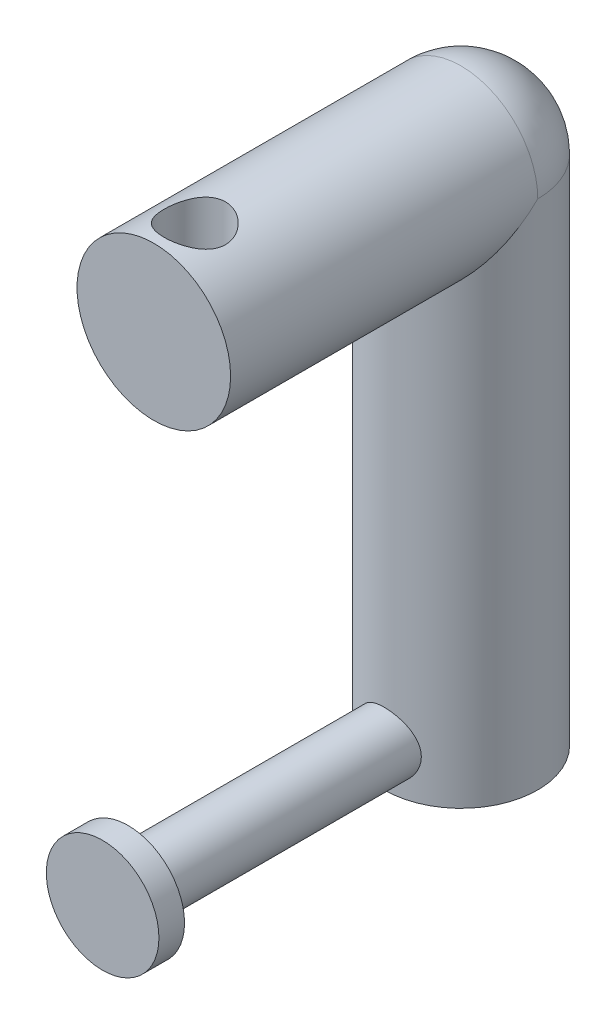
ISO-10303-21;
HEADER;
FILE_DESCRIPTION(('STEP AP214'),'2;1');
FILE_NAME('part.step','',(''),(''),'','','');
FILE_SCHEMA(('AUTOMOTIVE_DESIGN { 1 0 10303 214 1 1 1 1 }'));
ENDSEC;
DATA;
#1=APPLICATION_CONTEXT('core data for automotive mechanical design processes');
#2=APPLICATION_PROTOCOL_DEFINITION('international standard','automotive_design',2000,#1);
#3=PRODUCT_CONTEXT('',#1,'mechanical');
#4=PRODUCT('Part','Part','',(#3));
#5=PRODUCT_RELATED_PRODUCT_CATEGORY('part','',(#4));
#6=PRODUCT_DEFINITION_FORMATION('','',#4);
#7=PRODUCT_DEFINITION_CONTEXT('part definition',#1,'design');
#8=PRODUCT_DEFINITION('design','',#6,#7);
#9=PRODUCT_DEFINITION_SHAPE('','',#8);
#10=(LENGTH_UNIT() NAMED_UNIT(*) SI_UNIT(.MILLI.,.METRE.));
#11=(NAMED_UNIT(*) PLANE_ANGLE_UNIT() SI_UNIT($,.RADIAN.));
#12=(NAMED_UNIT(*) SI_UNIT($,.STERADIAN.) SOLID_ANGLE_UNIT());
#13=UNCERTAINTY_MEASURE_WITH_UNIT(LENGTH_MEASURE(1.E-05),#10,'distance_accuracy_value','');
#14=(GEOMETRIC_REPRESENTATION_CONTEXT(3) GLOBAL_UNCERTAINTY_ASSIGNED_CONTEXT((#13)) GLOBAL_UNIT_ASSIGNED_CONTEXT((#10,
#11,#12)) REPRESENTATION_CONTEXT('',''));
#15=CARTESIAN_POINT('',(0.,0.,0.));
#16=DIRECTION('',(0.,0.,1.));
#17=DIRECTION('',(1.,0.,0.));
#18=AXIS2_PLACEMENT_3D('',#15,#16,#17);
#19=CARTESIAN_POINT('',(0.,8.,65.));
#20=DIRECTION('',(0.,0.,-1.));
#21=DIRECTION('',(-1.,0.,0.));
#22=AXIS2_PLACEMENT_3D('',#19,#20,#21);
#23=CYLINDRICAL_SURFACE('',#22,6.);
#24=CARTESIAN_POINT('',(0.,8.,65.));
#25=DIRECTION('',(0.,0.,1.));
#26=DIRECTION('',(1.,0.,0.));
#27=AXIS2_PLACEMENT_3D('',#24,#25,#26);
#28=CIRCLE('',#27,6.);
#29=CARTESIAN_POINT('',(6.,8.,65.));
#30=VERTEX_POINT('',#29);
#31=EDGE_CURVE('E11',#30,#30,#28,.T.);
#32=ORIENTED_EDGE('',*,*,#31,.F.);
#33=EDGE_LOOP('',(#32));
#34=FACE_BOUND('',#33,.T.);
#35=CARTESIAN_POINT('',(6.,8.,13.7477270848675));
#36=CARTESIAN_POINT('',(5.99999875640954,8.16076598482738,13.7477283260629));
#37=CARTESIAN_POINT('',(5.99352975206176,8.32158110601548,13.7505565594333));
#38=CARTESIAN_POINT('',(5.96771672897827,8.64204882535129,13.7617785399654));
#39=CARTESIAN_POINT('',(5.94836482999676,8.80170065146873,13.7701756935283));
#40=CARTESIAN_POINT('',(5.89694174030869,9.11890142617686,13.7922754357519));
#41=CARTESIAN_POINT('',(5.86484520413903,9.27644553381237,13.8059885951419));
#42=CARTESIAN_POINT('',(5.78825391878448,9.58804060527395,13.8382744776157));
#43=CARTESIAN_POINT('',(5.74375401859824,9.74209008901072,13.8568492194736));
#44=CARTESIAN_POINT('',(5.64299599700453,10.0449832651282,13.8981849934125));
#45=CARTESIAN_POINT('',(5.58678827846126,10.1938461795796,13.9209280318917));
#46=CARTESIAN_POINT('',(5.46298123967255,10.4861745059142,13.969977180975));
#47=CARTESIAN_POINT('',(5.39537758446074,10.6296378383192,13.9962846467221));
#48=CARTESIAN_POINT('',(5.17633416323045,11.0504811630918,14.0794173286744));
#49=CARTESIAN_POINT('',(5.00853494267613,11.3186931077142,14.1405074748907));
#50=CARTESIAN_POINT('',(4.62391158998239,11.8378592545825,14.2710405221571));
#51=CARTESIAN_POINT('',(4.40499626343136,12.0871970513873,14.340752300891));
#52=CARTESIAN_POINT('',(4.0481020989243,12.4317390645763,14.4439708651047));
#53=CARTESIAN_POINT('',(3.9242905158216,12.5417399755175,14.4781748598032));
#54=CARTESIAN_POINT('',(3.66779743847793,12.7512789373329,14.5452673983772));
#55=CARTESIAN_POINT('',(3.53511902618019,12.850820593021,14.5781563930343));
#56=CARTESIAN_POINT('',(3.25615691069843,13.042541605752,14.6430448615306));
#57=CARTESIAN_POINT('',(3.10954147620186,13.1342681993675,14.6749563607157));
#58=CARTESIAN_POINT('',(2.80847871906791,13.3049385222444,14.7355355933009));
#59=CARTESIAN_POINT('',(2.65403441109174,13.3838871235516,14.7642045617649));
#60=CARTESIAN_POINT('',(2.33831705380736,13.5283274480482,14.8174861755334));
#61=CARTESIAN_POINT('',(2.1770447537532,13.5938206431435,14.8420992644581));
#62=CARTESIAN_POINT('',(1.8488303602226,13.710706307039,14.8865456688032));
#63=CARTESIAN_POINT('',(1.68188862975968,13.762099676745,14.9063792895972));
#64=CARTESIAN_POINT('',(1.35182764993867,13.8480957076311,14.9398371015626));
#65=CARTESIAN_POINT('',(1.18891435676812,13.8833905448022,14.9537153305611));
#66=CARTESIAN_POINT('',(0.860364736698413,13.940333707631,14.9762104160573));
#67=CARTESIAN_POINT('',(0.694728571347245,13.9619828399113,14.9848275835451));
#68=CARTESIAN_POINT('',(0.362083680846929,13.9913910715253,14.9965524359366));
#69=CARTESIAN_POINT('',(0.195075387211748,13.9991543815219,14.9996617909972));
#70=CARTESIAN_POINT('',(-0.139014166426377,14.0007146652515,15.0002858279534));
#71=CARTESIAN_POINT('',(-0.30609542365763,13.9945121299872,14.9978007065363));
#72=CARTESIAN_POINT('',(-0.629581360842823,13.9689571486784,14.9876056811723));
#73=CARTESIAN_POINT('',(-0.786056489987584,13.950366478925,14.9801985155737));
#74=CARTESIAN_POINT('',(-1.09682374164985,13.9009947102182,14.9606558816458));
#75=CARTESIAN_POINT('',(-1.25111513504043,13.8702096346988,14.9485188709466));
#76=CARTESIAN_POINT('',(-1.55636446880933,13.7967547638698,14.9198265516691));
#77=CARTESIAN_POINT('',(-1.70732347781249,13.7540888400518,14.9032726824411));
#78=CARTESIAN_POINT('',(-2.00504692560526,13.6572347463826,14.8661462906548));
#79=CARTESIAN_POINT('',(-2.15180974700395,13.6030421998243,14.8455722418593));
#80=CARTESIAN_POINT('',(-2.44232275401438,13.4827122452092,14.8005733913406));
#81=CARTESIAN_POINT('',(-2.58599723661979,13.4164113777625,14.7760965609745));
#82=CARTESIAN_POINT('',(-2.86725918170996,13.2729288476492,14.7241067343258));
#83=CARTESIAN_POINT('',(-3.00484439132129,13.1957432013856,14.696592627269));
#84=CARTESIAN_POINT('',(-3.40726603321778,12.948688374456,14.6104618941818));
#85=CARTESIAN_POINT('',(-3.66195901653258,12.7632418772394,14.5482260457696));
#86=CARTESIAN_POINT('',(-4.15437949370372,12.3419915764659,14.4156330049764));
#87=CARTESIAN_POINT('',(-4.38989525780835,12.1036809528053,14.3450108782861));
#88=CARTESIAN_POINT('',(-4.71121812404964,11.7191971043517,14.2413889925105));
#89=CARTESIAN_POINT('',(-4.81305918105095,11.5864329939912,14.2072110490304));
#90=CARTESIAN_POINT('',(-5.0054684951315,11.3125897118592,14.1405668936191));
#91=CARTESIAN_POINT('',(-5.09604089492643,11.171513624108,14.1081000551767));
#92=CARTESIAN_POINT('',(-5.2677144885335,10.8776679791937,14.0449207716186));
#93=CARTESIAN_POINT('',(-5.34846830074845,10.7246787891823,14.0142856556237));
#94=CARTESIAN_POINT('',(-5.49666677344656,10.4117640686962,13.9568252487564));
#95=CARTESIAN_POINT('',(-5.56411683616808,10.2518413860096,13.9299984127055));
#96=CARTESIAN_POINT('',(-5.68507549818268,9.92615715736025,13.8810726170423));
#97=CARTESIAN_POINT('',(-5.73858849912392,9.76039747367877,13.8589721651234));
#98=CARTESIAN_POINT('',(-5.83111405710325,9.42425050711976,13.8202977451039));
#99=CARTESIAN_POINT('',(-5.87012778144672,9.2538635979558,13.803723332125));
#100=CARTESIAN_POINT('',(-5.93126188446898,8.92037550293277,13.7775602957139));
#101=CARTESIAN_POINT('',(-5.95426866502425,8.75746509869363,13.7676067715781));
#102=CARTESIAN_POINT('',(-5.98682783069773,8.4300594191083,13.7534799529363));
#103=CARTESIAN_POINT('',(-5.99638101339171,8.26556423829532,13.7493063157788));
#104=CARTESIAN_POINT('',(-6.00192022727181,7.93634499724553,13.7468891908443));
#105=CARTESIAN_POINT('',(-5.99790972463034,7.77162100623468,13.7486441880165));
#106=CARTESIAN_POINT('',(-5.97637695694085,7.44323030234847,13.7580178863429));
#107=CARTESIAN_POINT('',(-5.95885503253298,7.27956356292335,13.7656364396694));
#108=CARTESIAN_POINT('',(-5.91189113707813,6.96388493285905,13.7858678469555));
#109=CARTESIAN_POINT('',(-5.88318889041452,6.81174216524755,13.7981698606254));
#110=CARTESIAN_POINT('',(-5.81422990546568,6.51049878730527,13.8273689308218));
#111=CARTESIAN_POINT('',(-5.77396942701893,6.36139917847391,13.8442674746596));
#112=CARTESIAN_POINT('',(-5.68227161206331,6.0672507608385,13.8821556875076));
#113=CARTESIAN_POINT('',(-5.63083646021821,5.92220116649752,13.9031445567712));
#114=CARTESIAN_POINT('',(-5.51718647350251,5.63689974950036,13.9486342853423));
#115=CARTESIAN_POINT('',(-5.45496750289055,5.49664979237216,13.9731364914375));
#116=CARTESIAN_POINT('',(-5.31751145640008,5.21622103433919,14.0260368054118));
#117=CARTESIAN_POINT('',(-5.24185178482307,5.07627148339986,14.054551887834));
#118=CARTESIAN_POINT('',(-5.07988717682862,4.80313174732677,14.1139004091642));
#119=CARTESIAN_POINT('',(-4.99357859530799,4.66994389885387,14.144734640495));
#120=CARTESIAN_POINT('',(-4.81086355761932,4.41103058661941,14.2079180408565));
#121=CARTESIAN_POINT('',(-4.71445526541627,4.28530648622995,14.2402674847459));
#122=CARTESIAN_POINT('',(-4.51210358125893,4.04197483985672,14.3056711379351));
#123=CARTESIAN_POINT('',(-4.40615981558121,3.92436761231666,14.338725374819));
#124=CARTESIAN_POINT('',(-4.17710486838273,3.68947089789745,14.4071898083664));
#125=CARTESIAN_POINT('',(-4.05330323673504,3.57285146369598,14.442592979753));
#126=CARTESIAN_POINT('',(-3.79611595891185,3.35044107746035,14.5123136561683));
#127=CARTESIAN_POINT('',(-3.66273336488668,3.24464670276108,14.5466315019691));
#128=CARTESIAN_POINT('',(-3.38706145939603,3.04451435610423,14.6132792135403));
#129=CARTESIAN_POINT('',(-3.24476806677012,2.95018169264924,14.6456081547515));
#130=CARTESIAN_POINT('',(-2.95225256674959,2.77378136334621,14.7073633349577));
#131=CARTESIAN_POINT('',(-2.80203390506011,2.69170842578634,14.7367908197248));
#132=CARTESIAN_POINT('',(-2.49453307495679,2.54045157600446,14.7919473555791));
#133=CARTESIAN_POINT('',(-2.3372490996887,2.47127098437562,14.8176754534518));
#134=CARTESIAN_POINT('',(-2.01680521759424,2.34650155372973,14.8646797598965));
#135=CARTESIAN_POINT('',(-1.85364780662784,2.29090701787589,14.8859578338886));
#136=CARTESIAN_POINT('',(-1.52264805192433,2.19385845199868,14.9234471639802));
#137=CARTESIAN_POINT('',(-1.35480680859647,2.15240113036746,14.9396595994531));
#138=CARTESIAN_POINT('',(-1.01574606559106,2.08407562736268,14.9665350610502));
#139=CARTESIAN_POINT('',(-0.844526795116487,2.05720645967028,14.9771984623478));
#140=CARTESIAN_POINT('',(-0.511396994408887,2.01963967541453,14.9921458117432));
#141=CARTESIAN_POINT('',(-0.349608608417646,2.00800071584866,14.9968008342727));
#142=CARTESIAN_POINT('',(-0.0255568035504901,1.99786526314398,15.0008532559057));
#143=CARTESIAN_POINT('',(0.13670659774313,1.99936828956347,15.0002508472092));
#144=CARTESIAN_POINT('',(0.460449157871509,2.01549904517884,14.9938053140504));
#145=CARTESIAN_POINT('',(0.621928426150297,2.03012488656084,14.9879629433954));
#146=CARTESIAN_POINT('',(0.942913616351041,2.07234304237388,14.9711970812456));
#147=CARTESIAN_POINT('',(1.10241954563224,2.09993530843377,14.9602736087057));
#148=CARTESIAN_POINT('',(1.41340092731344,2.16675006249559,14.9340514560138));
#149=CARTESIAN_POINT('',(1.56497209153591,2.20558587323356,14.9188987624389));
#150=CARTESIAN_POINT('',(1.86423948532529,2.29482683138478,14.8844652752771));
#151=CARTESIAN_POINT('',(2.01193442094207,2.34523578871987,14.8651831223981));
#152=CARTESIAN_POINT('',(2.302462712288,2.45717619515102,14.8229622791787));
#153=CARTESIAN_POINT('',(2.44529715629449,2.51870513472082,14.8000244139869));
#154=CARTESIAN_POINT('',(2.72537941223682,2.65243971671062,14.7510179336099));
#155=CARTESIAN_POINT('',(2.86262507421093,2.72464941936831,14.7249481285447));
#156=CARTESIAN_POINT('',(3.13662388518831,2.88260994638361,14.6690826919464));
#157=CARTESIAN_POINT('',(3.27309180108705,2.96881555131694,14.6391738407242));
#158=CARTESIAN_POINT('',(3.53838180351729,3.15171951689201,14.5773253906917));
#159=CARTESIAN_POINT('',(3.66720122604104,3.24842150069047,14.5453850922484));
#160=CARTESIAN_POINT('',(3.91649343612947,3.4517088619109,14.480251425724));
#161=CARTESIAN_POINT('',(4.03696455988819,3.55829619963079,14.447057809883));
#162=CARTESIAN_POINT('',(4.26890539529756,3.78072670262355,14.3802300314779));
#163=CARTESIAN_POINT('',(4.38037483126384,3.89657015115672,14.3465958554578));
#164=CARTESIAN_POINT('',(4.6003520349242,4.14436931770692,14.2776350231095));
#165=CARTESIAN_POINT('',(4.70824454883581,4.27687901691599,14.2423331872708));
#166=CARTESIAN_POINT('',(4.91246454048886,4.55081614977952,14.1731899755842));
#167=CARTESIAN_POINT('',(5.0087959135827,4.69224055512317,14.1393481102969));
#168=CARTESIAN_POINT('',(5.18930521843518,4.98330426589871,14.0741014017048));
#169=CARTESIAN_POINT('',(5.27347593316246,5.13294837739946,14.0426980106418));
#170=CARTESIAN_POINT('',(5.42888140715686,5.43938662075409,13.9833532160291));
#171=CARTESIAN_POINT('',(5.50012246229139,5.59617722596415,13.9554101296628));
#172=CARTESIAN_POINT('',(5.62329338728312,5.90161698772481,13.9062060888812));
#173=CARTESIAN_POINT('',(5.67638059374281,6.0497399517391,13.8845710059473));
#174=CARTESIAN_POINT('',(5.77085722264898,6.3501563851321,13.8455704717994));
#175=CARTESIAN_POINT('',(5.81225194839873,6.5024479292954,13.8282030853728));
#176=CARTESIAN_POINT('',(5.88290316620707,6.80992357107783,13.7982941020336));
#177=CARTESIAN_POINT('',(5.91218652902551,6.9651004584769,13.7857418266595));
#178=CARTESIAN_POINT('',(5.95843701087142,7.27754448449443,13.7658152395796));
#179=CARTESIAN_POINT('',(5.97541127868373,7.43481035575322,13.7584379224814));
#180=CARTESIAN_POINT('',(5.99076318011059,7.66032523302881,13.751755327731));
#181=CARTESIAN_POINT('',(5.99422579943118,7.72819955445766,13.7502459479373));
#182=CARTESIAN_POINT('',(5.99884455686221,7.86404631736154,13.7482315272618));
#183=CARTESIAN_POINT('',(6.00000052586257,7.9320187656651,13.7477265600177));
#184=CARTESIAN_POINT('',(6.,8.,13.7477270848675));
#185=B_SPLINE_CURVE_WITH_KNOTS('',3,(#35,#36,#37,#38,#39,#40,#41,#42,#43,#44,#45,#46,#47,#48,
#49,#50,#51,#52,#53,#54,#55,#56,#57,#58,#59,#60,#61,#62,#63,#64,#65,#66,#67,#68,#69,#70,#71,#72,
#73,#74,#75,#76,#77,#78,#79,#80,#81,#82,#83,#84,#85,#86,#87,#88,#89,#90,#91,#92,#93,#94,#95,#96,
#97,#98,#99,#100,#101,#102,#103,#104,#105,#106,#107,#108,#109,#110,#111,#112,#113,#114,#115,
#116,#117,#118,#119,#120,#121,#122,#123,#124,#125,#126,#127,#128,#129,#130,#131,#132,#133,#134,
#135,#136,#137,#138,#139,#140,#141,#142,#143,#144,#145,#146,#147,#148,#149,#150,#151,#152,#153,
#154,#155,#156,#157,#158,#159,#160,#161,#162,#163,#164,#165,#166,#167,#168,#169,#170,#171,#172,
#173,#174,#175,#176,#177,#178,#179,#180,#181,#182,#183,#184),.UNSPECIFIED.,.T.,.F.,(4,2,2,2,2,2,
2,2,2,2,2,2,2,2,2,2,2,2,2,2,2,2,2,2,2,2,2,2,2,2,2,2,2,2,2,2,2,2,2,2,2,2,2,2,2,2,2,2,2,2,2,2,2,2,
2,2,2,2,2,2,2,2,2,2,2,2,2,2,2,2,2,2,2,2,4),(0.,0.482229125007606,0.964753492666786,
1.44824230932755,1.93193221431692,2.41358131868909,2.89541405552194,3.85788445035762,
4.87027013417452,5.37714851669966,5.88385162504574,6.41078994114098,6.93752686828076,
7.4642061442031,7.99085176020979,8.4920122856123,8.99314318371741,9.49412209577398,
9.99508339499091,10.4677763229104,10.9406235219094,11.4133168189293,11.8861899210207,
12.3659950936627,12.8459763227003,13.8053197638543,14.827648638094,15.3395121452938,
15.8511869156833,16.3775800271824,16.9037589447638,17.429771480738,17.9557416594036,
18.4495809207953,18.9433909044569,19.4370747055101,19.9307460605728,20.3961592499499,
20.8617232138062,21.3271962410503,21.7928481801528,22.2772086524077,22.7617353827804,
23.2463503490362,23.7309843170643,24.2515501140932,24.7719508068031,25.2925916122044,
25.8130078923152,26.3335580277819,26.8538895128004,27.3740997647064,27.8942748403263,
28.3804860466243,28.8666794781986,29.3528029784681,29.8389246652723,30.309990273523,
30.7812111812125,31.2523258775871,31.7236201282936,32.2155707501999,32.7076917276986,
33.1999105039097,33.6921443490278,34.2149887213889,34.7376564316676,35.2606330684224,
35.7833543637692,36.2593204433439,36.7350702933027,37.2097588887462,37.684171576794,
37.8880712265046,38.0919858243933),.UNSPECIFIED.);
#186=CARTESIAN_POINT('',(6.,8.,13.7477270848675));
#187=VERTEX_POINT('',#186);
#188=EDGE_CURVE('E53',#187,#187,#185,.T.);
#189=ORIENTED_EDGE('',*,*,#188,.T.);
#190=EDGE_LOOP('',(#189));
#191=FACE_BOUND('',#190,.T.);
#192=ADVANCED_FACE('F47',(#34,#191),#23,.T.);
#193=CARTESIAN_POINT('',(0.,100.,0.));
#194=DIRECTION('',(0.,-1.,0.));
#195=DIRECTION('',(0.,0.,-1.));
#196=AXIS2_PLACEMENT_3D('',#193,#194,#195);
#197=CYLINDRICAL_SURFACE('',#196,15.);
#198=ORIENTED_EDGE('',*,*,#188,.F.);
#199=EDGE_LOOP('',(#198));
#200=FACE_BOUND('',#199,.T.);
#201=ADVANCED_FACE('F69',(#200),#197,.F.);
#202=CARTESIAN_POINT('',(0.,8.,70.));
#203=DIRECTION('',(0.,0.,-1.));
#204=DIRECTION('',(-1.,0.,0.));
#205=AXIS2_PLACEMENT_3D('',#202,#203,#204);
#206=CYLINDRICAL_SURFACE('',#205,11.);
#207=CARTESIAN_POINT('',(0.,8.,70.));
#208=DIRECTION('',(0.,0.,1.));
#209=DIRECTION('',(1.,0.,0.));
#210=AXIS2_PLACEMENT_3D('',#207,#208,#209);
#211=CIRCLE('',#210,11.);
#212=CARTESIAN_POINT('',(11.,8.,70.));
#213=VERTEX_POINT('',#212);
#214=EDGE_CURVE('E57',#213,#213,#211,.T.);
#215=ORIENTED_EDGE('',*,*,#214,.F.);
#216=EDGE_LOOP('',(#215));
#217=FACE_BOUND('',#216,.T.);
#218=CARTESIAN_POINT('',(0.,8.,65.));
#219=DIRECTION('',(0.,0.,1.));
#220=DIRECTION('',(1.,0.,0.));
#221=AXIS2_PLACEMENT_3D('',#218,#219,#220);
#222=CIRCLE('',#221,11.);
#223=CARTESIAN_POINT('',(11.,8.,65.));
#224=VERTEX_POINT('',#223);
#225=EDGE_CURVE('E61',#224,#224,#222,.T.);
#226=ORIENTED_EDGE('',*,*,#225,.T.);
#227=EDGE_LOOP('',(#226));
#228=FACE_BOUND('',#227,.T.);
#229=ADVANCED_FACE('F73',(#217,#228),#206,.T.);
#230=CARTESIAN_POINT('',(0.,8.,70.));
#231=DIRECTION('',(0.,0.,1.));
#232=DIRECTION('',(1.,0.,0.));
#233=AXIS2_PLACEMENT_3D('',#230,#231,#232);
#234=PLANE('',#233);
#235=ORIENTED_EDGE('',*,*,#214,.T.);
#236=EDGE_LOOP('',(#235));
#237=FACE_BOUND('',#236,.T.);
#238=ADVANCED_FACE('F77',(#237),#234,.T.);
#239=CARTESIAN_POINT('',(0.,8.,65.));
#240=DIRECTION('',(0.,0.,1.));
#241=DIRECTION('',(1.,0.,0.));
#242=AXIS2_PLACEMENT_3D('',#239,#240,#241);
#243=PLANE('',#242);
#244=ORIENTED_EDGE('',*,*,#31,.T.);
#245=EDGE_LOOP('',(#244));
#246=FACE_BOUND('',#245,.T.);
#247=ORIENTED_EDGE('',*,*,#225,.F.);
#248=EDGE_LOOP('',(#247));
#249=FACE_BOUND('',#248,.T.);
#250=ADVANCED_FACE('F79',(#246,#249),#243,.F.);
#251=CLOSED_SHELL('',(#192,#201,#229,#238,#250));
#252=MANIFOLD_SOLID_BREP('B2',#251);
#253=CARTESIAN_POINT('',(0.,100.,0.));
#254=DIRECTION('',(0.,-1.,0.));
#255=DIRECTION('',(0.,0.,-1.));
#256=AXIS2_PLACEMENT_3D('',#253,#254,#255);
#257=CYLINDRICAL_SURFACE('',#256,15.);
#258=CARTESIAN_POINT('',(0.,0.,0.));
#259=DIRECTION('',(0.,1.,0.));
#260=DIRECTION('',(0.,0.,1.));
#261=AXIS2_PLACEMENT_3D('',#258,#259,#260);
#262=CIRCLE('',#261,15.);
#263=CARTESIAN_POINT('',(0.,0.,15.));
#264=VERTEX_POINT('',#263);
#265=EDGE_CURVE('E130',#264,#264,#262,.T.);
#266=ORIENTED_EDGE('',*,*,#265,.T.);
#267=EDGE_LOOP('',(#266));
#268=FACE_BOUND('',#267,.T.);
#269=CARTESIAN_POINT('',(0.,100.,0.));
#270=DIRECTION('',(0.,-0.707106781186547,-0.707106781186547));
#271=DIRECTION('',(0.,-0.707106781186547,0.707106781186547));
#272=AXIS2_PLACEMENT_3D('',#269,#270,#271);
#273=ELLIPSE('',#272,21.2132034355964,15.);
#274=CARTESIAN_POINT('',(-15.,100.,0.));
#275=VERTEX_POINT('',#274);
#276=CARTESIAN_POINT('',(15.,100.,1.04744440165294E-13));
#277=VERTEX_POINT('',#276);
#278=EDGE_CURVE('E141',#275,#277,#273,.F.);
#279=ORIENTED_EDGE('',*,*,#278,.F.);
#280=CARTESIAN_POINT('',(0.,100.,0.));
#281=DIRECTION('',(0.,1.,0.));
#282=DIRECTION('',(0.,0.,1.));
#283=AXIS2_PLACEMENT_3D('',#280,#281,#282);
#284=CIRCLE('',#283,15.);
#285=EDGE_CURVE('E45',#277,#275,#284,.T.);
#286=ORIENTED_EDGE('',*,*,#285,.F.);
#287=EDGE_LOOP('',(#279,#286));
#288=FACE_BOUND('',#287,.T.);
#289=ADVANCED_FACE('F127',(#268,#288),#257,.T.);
#290=CARTESIAN_POINT('',(0.,0.,0.));
#291=DIRECTION('',(0.,1.,0.));
#292=DIRECTION('',(0.,0.,1.));
#293=AXIS2_PLACEMENT_3D('',#290,#291,#292);
#294=PLANE('',#293);
#295=ORIENTED_EDGE('',*,*,#265,.F.);
#296=EDGE_LOOP('',(#295));
#297=FACE_BOUND('',#296,.T.);
#298=ADVANCED_FACE('F155',(#297),#294,.F.);
#299=CARTESIAN_POINT('',(0.,100.,0.));
#300=DIRECTION('',(0.,1.,0.));
#301=DIRECTION('',(-1.,0.,0.));
#302=AXIS2_PLACEMENT_3D('',#299,#300,#301);
#303=SPHERICAL_SURFACE('',#302,15.);
#304=CARTESIAN_POINT('',(0.,100.,0.));
#305=DIRECTION('',(0.,0.,-1.));
#306=DIRECTION('',(-1.,0.,0.));
#307=AXIS2_PLACEMENT_3D('',#304,#305,#306);
#308=CIRCLE('',#307,15.);
#309=EDGE_CURVE('E143',#275,#277,#308,.T.);
#310=ORIENTED_EDGE('',*,*,#309,.T.);
#311=ORIENTED_EDGE('',*,*,#285,.T.);
#312=EDGE_LOOP('',(#310,#311));
#313=FACE_BOUND('',#312,.T.);
#314=ADVANCED_FACE('F153',(#313),#303,.T.);
#315=CARTESIAN_POINT('',(0.,100.,60.));
#316=DIRECTION('',(0.,0.,-1.));
#317=DIRECTION('',(-1.,0.,0.));
#318=AXIS2_PLACEMENT_3D('',#315,#316,#317);
#319=CYLINDRICAL_SURFACE('',#318,15.);
#320=CARTESIAN_POINT('',(0.,85.,58.));
#321=CARTESIAN_POINT('',(-0.161313644504796,85.0000007200578,57.999999076337));
#322=CARTESIAN_POINT('',(-0.322689516963509,85.0026094557128,57.9934855013958));
#323=CARTESIAN_POINT('',(-0.644299623195493,85.0129790603837,57.9674898782125));
#324=CARTESIAN_POINT('',(-0.804533022188132,85.0207433704531,57.9479991684452));
#325=CARTESIAN_POINT('',(-1.12295032515216,85.0412405280905,57.8961896196803));
#326=CARTESIAN_POINT('',(-1.28112908028619,85.0539840252668,57.863843282184));
#327=CARTESIAN_POINT('',(-1.5940111010847,85.0841076474644,57.7866317701457));
#328=CARTESIAN_POINT('',(-1.74871291854088,85.1014896670848,57.741761479865));
#329=CARTESIAN_POINT('',(-2.05297112205075,85.14036525012,57.6401188046392));
#330=CARTESIAN_POINT('',(-2.20254446893524,85.1618433198106,57.5833911959363));
#331=CARTESIAN_POINT('',(-2.49626491179011,85.2084217773626,57.4584017024408));
#332=CARTESIAN_POINT('',(-2.64040995626987,85.2335235177162,57.3901355093753));
#333=CARTESIAN_POINT('',(-2.92227692731373,85.2867119875235,57.2426681971428));
#334=CARTESIAN_POINT('',(-3.06000372368525,85.3147963990348,57.1634755552049));
#335=CARTESIAN_POINT('',(-3.32842124549353,85.3732943072994,56.9946751836688));
#336=CARTESIAN_POINT('',(-3.45910939916273,85.4037086456565,56.9050636845176));
#337=CARTESIAN_POINT('',(-3.8503463050522,85.5000421160479,56.6134009680257));
#338=CARTESIAN_POINT('',(-4.09812078052022,85.5687144016327,56.3947515037883));
#339=CARTESIAN_POINT('',(-4.55459108369287,85.7061993914462,55.9197284822013));
#340=CARTESIAN_POINT('',(-4.76326779263536,85.7750121478253,55.6633365776994));
#341=CARTESIAN_POINT('',(-5.04723766459798,85.8742762880717,55.2488756985875));
#342=CARTESIAN_POINT('',(-5.13866506559553,85.9073651161098,55.1022648970436));
#343=CARTESIAN_POINT('',(-5.30875946518037,85.9705560012794,54.8012358186711));
#344=CARTESIAN_POINT('',(-5.38743171147838,86.0006592847307,54.6468207871239));
#345=CARTESIAN_POINT('',(-5.53135072514938,86.0568964740729,54.3311496933484));
#346=CARTESIAN_POINT('',(-5.59659658448498,86.0830301114623,54.1698931693136));
#347=CARTESIAN_POINT('',(-5.71298893930062,86.1304034348634,53.8417492993048));
#348=CARTESIAN_POINT('',(-5.76414249748569,86.1516455714923,53.6748648211636));
#349=CARTESIAN_POINT('',(-5.84985002952935,86.187638928039,53.3442805788518));
#350=CARTESIAN_POINT('',(-5.88504634552834,86.2026388218328,53.1807744062204));
#351=CARTESIAN_POINT('',(-5.94169028877152,86.2269367964116,52.8510475821048));
#352=CARTESIAN_POINT('',(-5.96314412514811,86.236237452146,52.6848281913697));
#353=CARTESIAN_POINT('',(-5.99206783200916,86.2488046692949,52.3509840794924));
#354=CARTESIAN_POINT('',(-5.99954065663821,86.2520725054236,52.1833596627484));
#355=CARTESIAN_POINT('',(-6.00041818162586,86.2524553603,51.8480709001244));
#356=CARTESIAN_POINT('',(-5.99382353813072,86.2495706660189,51.6804065564715));
#357=CARTESIAN_POINT('',(-5.96760177471961,86.2381719442467,51.3581150722591));
#358=CARTESIAN_POINT('',(-5.94891756277296,86.2300653791778,51.2033956295018));
#359=CARTESIAN_POINT('',(-5.8996396544996,86.2088807245164,50.896159193445));
#360=CARTESIAN_POINT('',(-5.86904203850858,86.1958009987228,50.7436429421696));
#361=CARTESIAN_POINT('',(-5.79624600676145,86.1650771841395,50.4419202009817));
#362=CARTESIAN_POINT('',(-5.75405038400524,86.1474341943228,50.2927129235482));
#363=CARTESIAN_POINT('',(-5.65841794933909,86.1080966894326,49.9984373160379));
#364=CARTESIAN_POINT('',(-5.60497681726873,86.0864006176568,49.8533706010244));
#365=CARTESIAN_POINT('',(-5.48612076549079,86.0391028682875,49.5654107880334));
#366=CARTESIAN_POINT('',(-5.42048769239742,86.0134317403028,49.4226192329473));
#367=CARTESIAN_POINT('',(-5.27846344073438,85.9592165358569,49.1430045696326));
#368=CARTESIAN_POINT('',(-5.20206861926844,85.9306714874992,49.0061835030654));
#369=CARTESIAN_POINT('',(-5.03904071569064,85.8714619338073,48.7392438024992));
#370=CARTESIAN_POINT('',(-4.95240626250741,85.8407971448716,48.6091260694235));
#371=CARTESIAN_POINT('',(-4.7694272064266,85.7781184148979,48.3562485672333));
#372=CARTESIAN_POINT('',(-4.67308210238212,85.7461044042789,48.2334891783898));
#373=CARTESIAN_POINT('',(-4.46337699329054,85.678990833822,47.9867125608195));
#374=CARTESIAN_POINT('',(-4.34927691149484,85.6438445137024,47.8633359835572));
#375=CARTESIAN_POINT('',(-4.11112913327325,85.5738426959587,47.6265800239504));
#376=CARTESIAN_POINT('',(-3.98708438059708,85.53898711562,47.51319770389));
#377=CARTESIAN_POINT('',(-3.72964838124062,85.4704620878226,47.2970234364176));
#378=CARTESIAN_POINT('',(-3.59625179230497,85.436793335118,47.1942376264797));
#379=CARTESIAN_POINT('',(-3.32099627612082,85.3715695205646,47.0000661124244));
#380=CARTESIAN_POINT('',(-3.17914076240929,85.3400136168589,46.9086758551241));
#381=CARTESIAN_POINT('',(-2.88480363244261,85.2792343974222,46.7362002936664));
#382=CARTESIAN_POINT('',(-2.73216491576377,85.2500713242046,46.6553614031936));
#383=CARTESIAN_POINT('',(-2.41997061448609,85.1956481146639,46.5069497525717));
#384=CARTESIAN_POINT('',(-2.26041784404166,85.1703864091648,46.4393716558007));
#385=CARTESIAN_POINT('',(-1.93550182558386,85.124491840955,46.318108247081));
#386=CARTESIAN_POINT('',(-1.77013973685016,85.1038580607185,46.2644201809906));
#387=CARTESIAN_POINT('',(-1.43484781894989,85.0678323195841,46.1714951268274));
#388=CARTESIAN_POINT('',(-1.26491830691482,85.0524399957635,46.1322571382043));
#389=CARTESIAN_POINT('',(-0.932043665210944,85.0281104597,46.0705625046863));
#390=CARTESIAN_POINT('',(-0.769280790194169,85.0188449830014,46.0472497453174));
#391=CARTESIAN_POINT('',(-0.442179347982649,85.0056255915782,46.0140583525531));
#392=CARTESIAN_POINT('',(-0.277840858808296,85.0016714152056,46.0041790573915));
#393=CARTESIAN_POINT('',(0.0510959013325354,84.999185484946,45.9979633536429));
#394=CARTESIAN_POINT('',(0.215694106984595,85.0006525349162,46.0016239576039));
#395=CARTESIAN_POINT('',(0.543895620115944,85.0089652826815,46.0224408619377));
#396=CARTESIAN_POINT('',(0.707498946609738,85.0158108773522,46.0395969035585));
#397=CARTESIAN_POINT('',(1.02510006060182,85.0342616757631,46.0861386822579));
#398=CARTESIAN_POINT('',(1.17919782151467,85.0456378124758,46.1149367227416));
#399=CARTESIAN_POINT('',(1.48434586639605,85.0728372092811,46.1843994061311));
#400=CARTESIAN_POINT('',(1.63539513588515,85.0886619244493,46.2250679318946));
#401=CARTESIAN_POINT('',(1.93337901855314,85.1243635557249,46.3178883378395));
#402=CARTESIAN_POINT('',(2.08031476115195,85.1442393468992,46.3700370304434));
#403=CARTESIAN_POINT('',(2.36928412673675,85.1875778684626,46.4854096029213));
#404=CARTESIAN_POINT('',(2.51131586022716,85.211041962917,46.5486376958812));
#405=CARTESIAN_POINT('',(2.79382655828657,85.261759013214,46.6877436802185));
#406=CARTESIAN_POINT('',(2.93412902369549,85.2891050081393,46.7639459872758));
#407=CARTESIAN_POINT('',(3.20788342050322,85.346363952855,46.9270442086834));
#408=CARTESIAN_POINT('',(3.34133298209498,85.3762777812021,47.0139437874406));
#409=CARTESIAN_POINT('',(3.60064969677007,85.4379572555599,47.1978553315034));
#410=CARTESIAN_POINT('',(3.72651556540459,85.4697232134826,47.2948690022766));
#411=CARTESIAN_POINT('',(3.97000140926484,85.5343524787856,47.4984146200534));
#412=CARTESIAN_POINT('',(4.08762102489383,85.5672158339283,47.6049469816811));
#413=CARTESIAN_POINT('',(4.32151965753385,85.6354507123008,47.8343017011696));
#414=CARTESIAN_POINT('',(4.43719333742261,85.6708441315125,47.9577357303629));
#415=CARTESIAN_POINT('',(4.65775251008148,85.7410121716529,48.2139847630681));
#416=CARTESIAN_POINT('',(4.76264135223886,85.7757869819081,48.346796832349));
#417=CARTESIAN_POINT('',(4.9610580489563,85.8437678138675,48.6211572374989));
#418=CARTESIAN_POINT('',(5.05457937701835,85.8769729277304,48.7627105223442));
#419=CARTESIAN_POINT('',(5.22948651451797,85.9407988293012,49.0536021679197));
#420=CARTESIAN_POINT('',(5.31087742412304,85.9714207007556,49.2029372210024));
#421=CARTESIAN_POINT('',(5.46168285847214,86.0294374243861,49.5101026008407));
#422=CARTESIAN_POINT('',(5.53096653567014,86.0567961127809,49.6680041306304));
#423=CARTESIAN_POINT('',(5.65585321672464,86.1069853252467,49.9897540710099));
#424=CARTESIAN_POINT('',(5.71146207536686,86.1298177863783,50.1535999019847));
#425=CARTESIAN_POINT('',(5.80843082990244,86.1701448950943,50.486032936934));
#426=CARTESIAN_POINT('',(5.84979637281906,86.1876416577986,50.65461823312));
#427=CARTESIAN_POINT('',(5.91782050130812,86.2166486555749,50.9952343023737));
#428=CARTESIAN_POINT('',(5.94448031809037,86.2281593918113,51.1672647857494));
#429=CARTESIAN_POINT('',(5.98138158194365,86.244148716196,51.5008289388823));
#430=CARTESIAN_POINT('',(5.99266704417584,86.2490739888075,51.6622264630661));
#431=CARTESIAN_POINT('',(6.00216046200423,86.2532149589185,51.9854766489458));
#432=CARTESIAN_POINT('',(6.00036897454033,86.2524308995753,52.1473292909651));
#433=CARTESIAN_POINT('',(5.98373064604635,86.2451809080467,52.4702112209036));
#434=CARTESIAN_POINT('',(5.96888538854158,86.2387156650339,52.6312406063074));
#435=CARTESIAN_POINT('',(5.9263097432402,86.2203269663375,52.9512677749796));
#436=CARTESIAN_POINT('',(5.89857941471414,86.2084035357612,53.1102655675898));
#437=CARTESIAN_POINT('',(5.83188915830646,86.1800751428363,53.4187951135104));
#438=CARTESIAN_POINT('',(5.79342041323657,86.1638675614921,53.5684516805446));
#439=CARTESIAN_POINT('',(5.70522097391949,86.127266596468,53.863930328238));
#440=CARTESIAN_POINT('',(5.6554866099175,86.1068718490296,54.0097511420933));
#441=CARTESIAN_POINT('',(5.54517998972386,86.0624783606027,54.296647321415));
#442=CARTESIAN_POINT('',(5.4846091686947,86.0384800969256,54.4377233123424));
#443=CARTESIAN_POINT('',(5.35307990924357,85.9875231301795,54.7144117275927));
#444=CARTESIAN_POINT('',(5.28211769758923,85.9605633526433,54.8500221443966));
#445=CARTESIAN_POINT('',(5.04570156991896,85.8730685439742,55.2626644137898));
#446=CARTESIAN_POINT('',(4.86295379872225,85.8085485390652,55.5291851425362));
#447=CARTESIAN_POINT('',(4.4576185471272,85.6760708558405,56.0290508408562));
#448=CARTESIAN_POINT('',(4.2350190587282,85.6081121458242,56.2623857728528));
#449=CARTESIAN_POINT('',(3.86726006921135,85.5064855119623,56.5906111142667));
#450=CARTESIAN_POINT('',(3.73448315683694,85.4716249640093,56.6992669907362));
#451=CARTESIAN_POINT('',(3.45982226643504,85.403781141815,56.9050013050422));
#452=CARTESIAN_POINT('',(3.31794165644068,85.3707971817292,57.0020839869774));
#453=CARTESIAN_POINT('',(3.02578567613311,85.307587521917,57.1840400830178));
#454=CARTESIAN_POINT('',(2.87550254240776,85.2773644433031,57.2689019381306));
#455=CARTESIAN_POINT('',(2.56769193761231,85.2205740377765,57.4255655037111));
#456=CARTESIAN_POINT('',(2.41016781863784,85.1940050415595,57.4973731826112));
#457=CARTESIAN_POINT('',(2.09182205260197,85.1457168766986,57.6261198404165));
#458=CARTESIAN_POINT('',(1.93111197302126,85.1239185114088,57.6833047935241));
#459=CARTESIAN_POINT('',(1.60493222642554,85.0852038339497,57.7838828055145));
#460=CARTESIAN_POINT('',(1.43946483501728,85.0682852289621,57.8272823426273));
#461=CARTESIAN_POINT('',(1.10541479414028,85.0398498586039,57.8997628026109));
#462=CARTESIAN_POINT('',(0.936841087451797,85.0283195321336,57.9288796810461));
#463=CARTESIAN_POINT('',(0.59761820577061,85.0109489226024,57.9726090796245));
#464=CARTESIAN_POINT('',(0.426970701489365,85.0051043315317,57.9872325813745));
#465=CARTESIAN_POINT('',(0.213390422685862,85.0014570552551,57.9963563929729));
#466=CARTESIAN_POINT('',(0.170726823310688,85.0009108974964,57.99772244129));
#467=CARTESIAN_POINT('',(0.0853769353554073,85.0001822746741,57.9995443668125));
#468=CARTESIAN_POINT('',(0.0426906467858722,84.9999998094412,58.0000002444416));
#469=CARTESIAN_POINT('',(0.,85.,58.));
#470=B_SPLINE_CURVE_WITH_KNOTS('',3,(#320,#321,#322,#323,#324,#325,#326,#327,#328,#329,#330,
#331,#332,#333,#334,#335,#336,#337,#338,#339,#340,#341,#342,#343,#344,#345,#346,#347,#348,#349,
#350,#351,#352,#353,#354,#355,#356,#357,#358,#359,#360,#361,#362,#363,#364,#365,#366,#367,#368,
#369,#370,#371,#372,#373,#374,#375,#376,#377,#378,#379,#380,#381,#382,#383,#384,#385,#386,#387,
#388,#389,#390,#391,#392,#393,#394,#395,#396,#397,#398,#399,#400,#401,#402,#403,#404,#405,#406,
#407,#408,#409,#410,#411,#412,#413,#414,#415,#416,#417,#418,#419,#420,#421,#422,#423,#424,#425,
#426,#427,#428,#429,#430,#431,#432,#433,#434,#435,#436,#437,#438,#439,#440,#441,#442,#443,#444,
#445,#446,#447,#448,#449,#450,#451,#452,#453,#454,#455,#456,#457,#458,#459,#460,#461,#462,#463,
#464,#465,#466,#467,#468,#469),.UNSPECIFIED.,.T.,.F.,(4,2,2,2,2,2,2,2,2,2,2,2,2,2,2,2,2,2,2,2,2,
2,2,2,2,2,2,2,2,2,2,2,2,2,2,2,2,2,2,2,2,2,2,2,2,2,2,2,2,2,2,2,2,2,2,2,2,2,2,2,2,2,2,2,2,2,2,2,2,
2,2,2,2,2,4),(0.,0.48389705415282,0.968117407228015,1.45337914245595,1.93883938645661,
2.42249849868244,2.90633859994029,3.38980540538342,3.87344767714067,4.88128652111307,
5.8896169181335,6.41682474002604,6.94381510524777,7.47084109954819,7.99760247923351,
8.50070582790118,9.00358170358742,9.50635131114939,10.0090974686366,10.4767118882454,
10.9444802892416,11.4121361420904,11.8799719822379,12.357167111748,12.8345241636783,
13.3119452055687,13.7893908988145,14.3038604025315,14.8181781750485,15.3327921850973,
15.8471999136586,16.3720340444751,16.8966565279702,17.4211749084574,17.945656963481,
18.4390821626358,18.9324830535441,19.4257750866616,19.9190576619765,20.3900487373938,
20.8611940478454,21.3322087049456,21.8034028617177,22.2888301938794,22.7744242768985,
23.2601003750447,23.7457976390534,24.2636804561109,24.7814019482706,25.299419292813,
25.8172182216539,26.3403070717152,26.8631715731925,27.3858285361306,27.9084417339339,
28.3934227501986,28.8783831115163,29.3632846514299,29.8481839608478,30.3137727734817,
30.7795134694854,31.2451925291595,31.7110411034411,32.695156070987,33.6795680697381,
34.2042554172968,34.7287497567621,35.2537369726936,35.7784835549451,36.2937161550921,
36.8087062706882,37.3223931958723,37.8356906031082,37.9637509906823,38.0918113186414),.UNSPECIFIED.);
#471=CARTESIAN_POINT('',(0.,85.,58.));
#472=VERTEX_POINT('',#471);
#473=EDGE_CURVE('E175',#472,#472,#470,.T.);
#474=ORIENTED_EDGE('',*,*,#473,.F.);
#475=EDGE_LOOP('',(#474));
#476=FACE_BOUND('',#475,.T.);
#477=CARTESIAN_POINT('',(0.,115.,58.));
#478=CARTESIAN_POINT('',(0.161313644504796,114.999999279942,57.999999076337));
#479=CARTESIAN_POINT('',(0.322689516963509,114.997390544287,57.9934855013958));
#480=CARTESIAN_POINT('',(0.644299623195493,114.987020939616,57.9674898782125));
#481=CARTESIAN_POINT('',(0.804533022188132,114.979256629547,57.9479991684452));
#482=CARTESIAN_POINT('',(1.12295032515216,114.958759471909,57.8961896196803));
#483=CARTESIAN_POINT('',(1.28112908028619,114.946015974733,57.863843282184));
#484=CARTESIAN_POINT('',(1.5940111010847,114.915892352536,57.7866317701457));
#485=CARTESIAN_POINT('',(1.74871291854088,114.898510332915,57.741761479865));
#486=CARTESIAN_POINT('',(2.05297112205075,114.85963474988,57.6401188046392));
#487=CARTESIAN_POINT('',(2.20254446893524,114.838156680189,57.5833911959363));
#488=CARTESIAN_POINT('',(2.49626491179011,114.791578222637,57.4584017024408));
#489=CARTESIAN_POINT('',(2.64040995626987,114.766476482284,57.3901355093753));
#490=CARTESIAN_POINT('',(2.92227692731373,114.713288012477,57.2426681971428));
#491=CARTESIAN_POINT('',(3.06000372368525,114.685203600965,57.1634755552049));
#492=CARTESIAN_POINT('',(3.32842124549353,114.626705692701,56.9946751836688));
#493=CARTESIAN_POINT('',(3.45910939916273,114.596291354344,56.9050636845176));
#494=CARTESIAN_POINT('',(3.8503463050522,114.499957883952,56.6134009680257));
#495=CARTESIAN_POINT('',(4.09812078052022,114.431285598367,56.3947515037883));
#496=CARTESIAN_POINT('',(4.55459108369287,114.293800608554,55.9197284822013));
#497=CARTESIAN_POINT('',(4.76326779263536,114.224987852175,55.6633365776994));
#498=CARTESIAN_POINT('',(5.04723766459798,114.125723711928,55.2488756985875));
#499=CARTESIAN_POINT('',(5.13866506559553,114.09263488389,55.1022648970436));
#500=CARTESIAN_POINT('',(5.30875946518037,114.029443998721,54.8012358186711));
#501=CARTESIAN_POINT('',(5.38743171147838,113.999340715269,54.6468207871239));
#502=CARTESIAN_POINT('',(5.53135072514938,113.943103525927,54.3311496933484));
#503=CARTESIAN_POINT('',(5.59659658448498,113.916969888538,54.1698931693136));
#504=CARTESIAN_POINT('',(5.71298893930062,113.869596565137,53.8417492993048));
#505=CARTESIAN_POINT('',(5.76414249748569,113.848354428508,53.6748648211636));
#506=CARTESIAN_POINT('',(5.84985002952935,113.812361071961,53.3442805788518));
#507=CARTESIAN_POINT('',(5.88504634552834,113.797361178167,53.1807744062204));
#508=CARTESIAN_POINT('',(5.94169028877152,113.773063203588,52.8510475821048));
#509=CARTESIAN_POINT('',(5.96314412514811,113.763762547854,52.6848281913697));
#510=CARTESIAN_POINT('',(5.99206783200916,113.751195330705,52.3509840794924));
#511=CARTESIAN_POINT('',(5.99954065663821,113.747927494576,52.1833596627484));
#512=CARTESIAN_POINT('',(6.00041818162586,113.7475446397,51.8480709001244));
#513=CARTESIAN_POINT('',(5.99382353813072,113.750429333981,51.6804065564715));
#514=CARTESIAN_POINT('',(5.96760177471961,113.761828055753,51.3581150722591));
#515=CARTESIAN_POINT('',(5.94891756277296,113.769934620822,51.2033956295018));
#516=CARTESIAN_POINT('',(5.8996396544996,113.791119275484,50.896159193445));
#517=CARTESIAN_POINT('',(5.86904203850858,113.804199001277,50.7436429421696));
#518=CARTESIAN_POINT('',(5.79624600676145,113.83492281586,50.4419202009817));
#519=CARTESIAN_POINT('',(5.75405038400524,113.852565805677,50.2927129235482));
#520=CARTESIAN_POINT('',(5.65841794933909,113.891903310567,49.9984373160379));
#521=CARTESIAN_POINT('',(5.60497681726873,113.913599382343,49.8533706010244));
#522=CARTESIAN_POINT('',(5.48612076549079,113.960897131712,49.5654107880334));
#523=CARTESIAN_POINT('',(5.42048769239742,113.986568259697,49.4226192329473));
#524=CARTESIAN_POINT('',(5.27846344073438,114.040783464143,49.1430045696326));
#525=CARTESIAN_POINT('',(5.20206861926844,114.069328512501,49.0061835030654));
#526=CARTESIAN_POINT('',(5.03904071569064,114.128538066193,48.7392438024992));
#527=CARTESIAN_POINT('',(4.95240626250741,114.159202855128,48.6091260694235));
#528=CARTESIAN_POINT('',(4.7694272064266,114.221881585102,48.3562485672333));
#529=CARTESIAN_POINT('',(4.67308210238212,114.253895595721,48.2334891783898));
#530=CARTESIAN_POINT('',(4.46337699329054,114.321009166178,47.9867125608195));
#531=CARTESIAN_POINT('',(4.34927691149484,114.356155486298,47.8633359835572));
#532=CARTESIAN_POINT('',(4.11112913327325,114.426157304041,47.6265800239504));
#533=CARTESIAN_POINT('',(3.98708438059708,114.46101288438,47.51319770389));
#534=CARTESIAN_POINT('',(3.72964838124062,114.529537912177,47.2970234364176));
#535=CARTESIAN_POINT('',(3.59625179230497,114.563206664882,47.1942376264797));
#536=CARTESIAN_POINT('',(3.32099627612082,114.628430479435,47.0000661124244));
#537=CARTESIAN_POINT('',(3.17914076240929,114.659986383141,46.9086758551241));
#538=CARTESIAN_POINT('',(2.88480363244261,114.720765602578,46.7362002936664));
#539=CARTESIAN_POINT('',(2.73216491576377,114.749928675795,46.6553614031936));
#540=CARTESIAN_POINT('',(2.41997061448609,114.804351885336,46.5069497525717));
#541=CARTESIAN_POINT('',(2.26041784404165,114.829613590835,46.4393716558007));
#542=CARTESIAN_POINT('',(1.93550182558386,114.875508159045,46.318108247081));
#543=CARTESIAN_POINT('',(1.77013973685015,114.896141939282,46.2644201809906));
#544=CARTESIAN_POINT('',(1.43484781894989,114.932167680416,46.1714951268274));
#545=CARTESIAN_POINT('',(1.26491830691482,114.947560004237,46.1322571382043));
#546=CARTESIAN_POINT('',(0.932043665210944,114.9718895403,46.0705625046863));
#547=CARTESIAN_POINT('',(0.769280790194169,114.981155016999,46.0472497453174));
#548=CARTESIAN_POINT('',(0.442179347982649,114.994374408422,46.0140583525531));
#549=CARTESIAN_POINT('',(0.277840858808296,114.998328584794,46.0041790573915));
#550=CARTESIAN_POINT('',(-0.0510959013325354,115.000814515054,45.9979633536429));
#551=CARTESIAN_POINT('',(-0.215694106984595,114.999347465084,46.0016239576039));
#552=CARTESIAN_POINT('',(-0.543895620115944,114.991034717319,46.0224408619377));
#553=CARTESIAN_POINT('',(-0.707498946609738,114.984189122648,46.0395969035585));
#554=CARTESIAN_POINT('',(-1.02510006060182,114.965738324237,46.0861386822579));
#555=CARTESIAN_POINT('',(-1.17919782151467,114.954362187524,46.1149367227416));
#556=CARTESIAN_POINT('',(-1.48434586639605,114.927162790719,46.1843994061311));
#557=CARTESIAN_POINT('',(-1.63539513588515,114.911338075551,46.2250679318946));
#558=CARTESIAN_POINT('',(-1.93337901855315,114.875636444275,46.3178883378395));
#559=CARTESIAN_POINT('',(-2.08031476115196,114.855760653101,46.3700370304434));
#560=CARTESIAN_POINT('',(-2.36928412673676,114.812422131537,46.4854096029213));
#561=CARTESIAN_POINT('',(-2.51131586022716,114.788958037083,46.5486376958812));
#562=CARTESIAN_POINT('',(-2.79382655828656,114.738240986786,46.6877436802185));
#563=CARTESIAN_POINT('',(-2.93412902369549,114.710894991861,46.7639459872758));
#564=CARTESIAN_POINT('',(-3.20788342050322,114.653636047145,46.9270442086834));
#565=CARTESIAN_POINT('',(-3.34133298209498,114.623722218798,47.0139437874406));
#566=CARTESIAN_POINT('',(-3.60064969677007,114.56204274444,47.1978553315034));
#567=CARTESIAN_POINT('',(-3.72651556540459,114.530276786517,47.2948690022766));
#568=CARTESIAN_POINT('',(-3.97000140926484,114.465647521214,47.4984146200534));
#569=CARTESIAN_POINT('',(-4.08762102489383,114.432784166072,47.6049469816811));
#570=CARTESIAN_POINT('',(-4.32151965753385,114.364549287699,47.8343017011696));
#571=CARTESIAN_POINT('',(-4.4371933374226,114.329155868488,47.9577357303629));
#572=CARTESIAN_POINT('',(-4.65775251008148,114.258987828347,48.2139847630681));
#573=CARTESIAN_POINT('',(-4.76264135223886,114.224213018092,48.346796832349));
#574=CARTESIAN_POINT('',(-4.9610580489563,114.156232186132,48.6211572374989));
#575=CARTESIAN_POINT('',(-5.05457937701835,114.12302707227,48.7627105223442));
#576=CARTESIAN_POINT('',(-5.22948651451797,114.059201170699,49.0536021679197));
#577=CARTESIAN_POINT('',(-5.31087742412304,114.028579299244,49.2029372210025));
#578=CARTESIAN_POINT('',(-5.46168285847214,113.970562575614,49.5101026008407));
#579=CARTESIAN_POINT('',(-5.53096653567014,113.943203887219,49.6680041306304));
#580=CARTESIAN_POINT('',(-5.65585321672464,113.893014674753,49.9897540710099));
#581=CARTESIAN_POINT('',(-5.71146207536686,113.870182213622,50.1535999019847));
#582=CARTESIAN_POINT('',(-5.80843082990244,113.829855104906,50.486032936934));
#583=CARTESIAN_POINT('',(-5.84979637281906,113.812358342201,50.65461823312));
#584=CARTESIAN_POINT('',(-5.91782050130812,113.783351344425,50.9952343023737));
#585=CARTESIAN_POINT('',(-5.94448031809037,113.771840608189,51.1672647857494));
#586=CARTESIAN_POINT('',(-5.98138158194365,113.755851283804,51.5008289388823));
#587=CARTESIAN_POINT('',(-5.99266704417584,113.750926011193,51.6622264630661));
#588=CARTESIAN_POINT('',(-6.00216046200423,113.746785041082,51.9854766489458));
#589=CARTESIAN_POINT('',(-6.00036897454033,113.747569100425,52.1473292909651));
#590=CARTESIAN_POINT('',(-5.98373064604635,113.754819091953,52.4702112209036));
#591=CARTESIAN_POINT('',(-5.96888538854158,113.761284334966,52.6312406063074));
#592=CARTESIAN_POINT('',(-5.9263097432402,113.779673033663,52.9512677749796));
#593=CARTESIAN_POINT('',(-5.89857941471414,113.791596464239,53.1102655675898));
#594=CARTESIAN_POINT('',(-5.83188915830646,113.819924857164,53.4187951135104));
#595=CARTESIAN_POINT('',(-5.79342041323657,113.836132438508,53.5684516805446));
#596=CARTESIAN_POINT('',(-5.70522097391949,113.872733403532,53.863930328238));
#597=CARTESIAN_POINT('',(-5.6554866099175,113.89312815097,54.0097511420933));
#598=CARTESIAN_POINT('',(-5.54517998972386,113.937521639397,54.296647321415));
#599=CARTESIAN_POINT('',(-5.4846091686947,113.961519903074,54.4377233123424));
#600=CARTESIAN_POINT('',(-5.35307990924357,114.01247686982,54.7144117275927));
#601=CARTESIAN_POINT('',(-5.28211769758923,114.039436647357,54.8500221443966));
#602=CARTESIAN_POINT('',(-5.04570156991896,114.126931456026,55.2626644137898));
#603=CARTESIAN_POINT('',(-4.86295379872225,114.191451460935,55.5291851425362));
#604=CARTESIAN_POINT('',(-4.4576185471272,114.32392914416,56.0290508408562));
#605=CARTESIAN_POINT('',(-4.2350190587282,114.391887854176,56.2623857728528));
#606=CARTESIAN_POINT('',(-3.86726006921135,114.493514488038,56.5906111142667));
#607=CARTESIAN_POINT('',(-3.73448315683694,114.528375035991,56.6992669907362));
#608=CARTESIAN_POINT('',(-3.45982226643504,114.596218858185,56.9050013050422));
#609=CARTESIAN_POINT('',(-3.31794165644068,114.629202818271,57.0020839869774));
#610=CARTESIAN_POINT('',(-3.02578567613311,114.692412478083,57.1840400830178));
#611=CARTESIAN_POINT('',(-2.87550254240776,114.722635556697,57.2689019381306));
#612=CARTESIAN_POINT('',(-2.56769193761231,114.779425962223,57.4255655037111));
#613=CARTESIAN_POINT('',(-2.41016781863784,114.80599495844,57.4973731826112));
#614=CARTESIAN_POINT('',(-2.09182205260197,114.854283123301,57.6261198404165));
#615=CARTESIAN_POINT('',(-1.93111197302126,114.876081488591,57.6833047935241));
#616=CARTESIAN_POINT('',(-1.60493222642554,114.91479616605,57.7838828055145));
#617=CARTESIAN_POINT('',(-1.43946483501728,114.931714771038,57.8272823426273));
#618=CARTESIAN_POINT('',(-1.10541479414028,114.960150141396,57.8997628026109));
#619=CARTESIAN_POINT('',(-0.936841087451798,114.971680467866,57.9288796810461));
#620=CARTESIAN_POINT('',(-0.597618205770611,114.989051077398,57.9726090796245));
#621=CARTESIAN_POINT('',(-0.426970701489365,114.994895668468,57.9872325813745));
#622=CARTESIAN_POINT('',(-0.213390422685862,114.998542944745,57.9963563929729));
#623=CARTESIAN_POINT('',(-0.170726823310688,114.999089102504,57.99772244129));
#624=CARTESIAN_POINT('',(-0.0853769353554073,114.999817725326,57.9995443668125));
#625=CARTESIAN_POINT('',(-0.0426906467858722,115.000000190559,58.0000002444416));
#626=CARTESIAN_POINT('',(0.,115.,58.));
#627=B_SPLINE_CURVE_WITH_KNOTS('',3,(#477,#478,#479,#480,#481,#482,#483,#484,#485,#486,#487,
#488,#489,#490,#491,#492,#493,#494,#495,#496,#497,#498,#499,#500,#501,#502,#503,#504,#505,#506,
#507,#508,#509,#510,#511,#512,#513,#514,#515,#516,#517,#518,#519,#520,#521,#522,#523,#524,#525,
#526,#527,#528,#529,#530,#531,#532,#533,#534,#535,#536,#537,#538,#539,#540,#541,#542,#543,#544,
#545,#546,#547,#548,#549,#550,#551,#552,#553,#554,#555,#556,#557,#558,#559,#560,#561,#562,#563,
#564,#565,#566,#567,#568,#569,#570,#571,#572,#573,#574,#575,#576,#577,#578,#579,#580,#581,#582,
#583,#584,#585,#586,#587,#588,#589,#590,#591,#592,#593,#594,#595,#596,#597,#598,#599,#600,#601,
#602,#603,#604,#605,#606,#607,#608,#609,#610,#611,#612,#613,#614,#615,#616,#617,#618,#619,#620,
#621,#622,#623,#624,#625,#626),.UNSPECIFIED.,.T.,.F.,(4,2,2,2,2,2,2,2,2,2,2,2,2,2,2,2,2,2,2,2,2,
2,2,2,2,2,2,2,2,2,2,2,2,2,2,2,2,2,2,2,2,2,2,2,2,2,2,2,2,2,2,2,2,2,2,2,2,2,2,2,2,2,2,2,2,2,2,2,2,
2,2,2,2,2,4),(0.,0.48389705415282,0.968117407228015,1.45337914245595,1.93883938645661,
2.42249849868244,2.90633859994029,3.38980540538342,3.87344767714067,4.88128652111307,
5.8896169181335,6.41682474002604,6.94381510524777,7.47084109954819,7.99760247923351,
8.50070582790118,9.00358170358742,9.50635131114939,10.0090974686366,10.4767118882454,
10.9444802892416,11.4121361420904,11.8799719822379,12.357167111748,12.8345241636783,
13.3119452055687,13.7893908988145,14.3038604025315,14.8181781750485,15.3327921850973,
15.8471999136586,16.3720340444751,16.8966565279702,17.4211749084574,17.945656963481,
18.4390821626358,18.9324830535441,19.4257750866616,19.9190576619765,20.3900487373938,
20.8611940478454,21.3322087049456,21.8034028617177,22.2888301938794,22.7744242768985,
23.2601003750447,23.7457976390534,24.2636804561109,24.7814019482706,25.299419292813,
25.8172182216539,26.3403070717152,26.8631715731926,27.3858285361306,27.9084417339339,
28.3934227501986,28.8783831115163,29.3632846514299,29.8481839608478,30.3137727734817,
30.7795134694854,31.2451925291595,31.7110411034411,32.695156070987,33.6795680697381,
34.2042554172969,34.7287497567621,35.2537369726936,35.7784835549451,36.2937161550921,
36.8087062706882,37.3223931958723,37.8356906031082,37.9637509906823,38.0918113186414),.UNSPECIFIED.);
#628=CARTESIAN_POINT('',(0.,115.,58.));
#629=VERTEX_POINT('',#628);
#630=EDGE_CURVE('E179',#629,#629,#627,.T.);
#631=ORIENTED_EDGE('',*,*,#630,.F.);
#632=EDGE_LOOP('',(#631));
#633=FACE_BOUND('',#632,.T.);
#634=CARTESIAN_POINT('',(0.,100.,60.));
#635=DIRECTION('',(0.,0.,1.));
#636=DIRECTION('',(1.,0.,0.));
#637=AXIS2_PLACEMENT_3D('',#634,#635,#636);
#638=CIRCLE('',#637,15.);
#639=CARTESIAN_POINT('',(15.,100.,60.));
#640=VERTEX_POINT('',#639);
#641=EDGE_CURVE('E151',#640,#640,#638,.T.);
#642=ORIENTED_EDGE('',*,*,#641,.F.);
#643=EDGE_LOOP('',(#642));
#644=FACE_BOUND('',#643,.T.);
#645=ORIENTED_EDGE('',*,*,#309,.F.);
#646=ORIENTED_EDGE('',*,*,#278,.T.);
#647=EDGE_LOOP('',(#645,#646));
#648=FACE_BOUND('',#647,.T.);
#649=ADVANCED_FACE('F144',(#476,#633,#644,#648),#319,.T.);
#650=CARTESIAN_POINT('',(0.,100.,60.));
#651=DIRECTION('',(0.,0.,1.));
#652=DIRECTION('',(1.,0.,0.));
#653=AXIS2_PLACEMENT_3D('',#650,#651,#652);
#654=PLANE('',#653);
#655=ORIENTED_EDGE('',*,*,#641,.T.);
#656=EDGE_LOOP('',(#655));
#657=FACE_BOUND('',#656,.T.);
#658=ADVANCED_FACE('F161',(#657),#654,.T.);
#659=CARTESIAN_POINT('',(0.,-0.001000000000001,52.));
#660=DIRECTION('',(0.,1.,0.));
#661=DIRECTION('',(0.,0.,1.));
#662=AXIS2_PLACEMENT_3D('',#659,#660,#661);
#663=CYLINDRICAL_SURFACE('',#662,6.);
#664=ORIENTED_EDGE('',*,*,#473,.T.);
#665=EDGE_LOOP('',(#664));
#666=FACE_BOUND('',#665,.T.);
#667=ORIENTED_EDGE('',*,*,#630,.T.);
#668=EDGE_LOOP('',(#667));
#669=FACE_BOUND('',#668,.T.);
#670=ADVANCED_FACE('F193',(#666,#669),#663,.F.);
#671=CLOSED_SHELL('',(#289,#298,#314,#649,#658,#670));
#672=MANIFOLD_SOLID_BREP('B6',#671);
#673=ADVANCED_BREP_SHAPE_REPRESENTATION('',(#18,#252,#672),#14);
#674=SHAPE_DEFINITION_REPRESENTATION(#9,#673);
ENDSEC;
END-ISO-10303-21;
